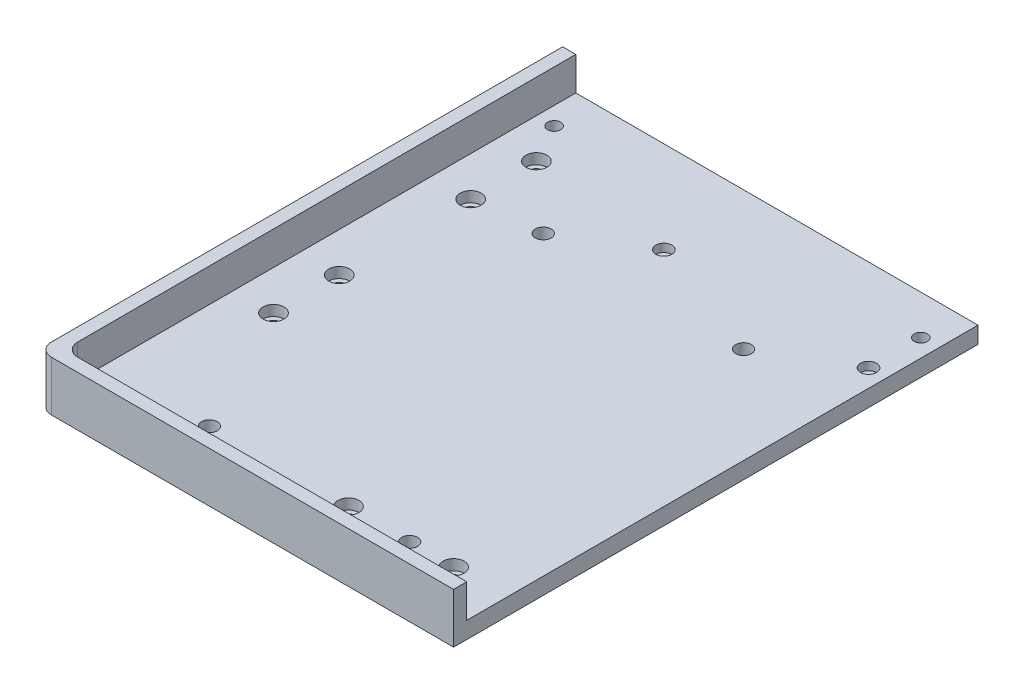
ISO-10303-21;
HEADER;
FILE_DESCRIPTION(('STEP AP214'),'2;1');
FILE_NAME('part.step','',(''),(''),'','','');
FILE_SCHEMA(('AUTOMOTIVE_DESIGN { 1 0 10303 214 1 1 1 1 }'));
ENDSEC;
DATA;
#1=APPLICATION_CONTEXT('core data for automotive mechanical design processes');
#2=APPLICATION_PROTOCOL_DEFINITION('international standard','automotive_design',2000,#1);
#3=PRODUCT_CONTEXT('',#1,'mechanical');
#4=PRODUCT('Part','Part','',(#3));
#5=PRODUCT_RELATED_PRODUCT_CATEGORY('part','',(#4));
#6=PRODUCT_DEFINITION_FORMATION('','',#4);
#7=PRODUCT_DEFINITION_CONTEXT('part definition',#1,'design');
#8=PRODUCT_DEFINITION('design','',#6,#7);
#9=PRODUCT_DEFINITION_SHAPE('','',#8);
#10=(LENGTH_UNIT() NAMED_UNIT(*) SI_UNIT(.MILLI.,.METRE.));
#11=(NAMED_UNIT(*) PLANE_ANGLE_UNIT() SI_UNIT($,.RADIAN.));
#12=(NAMED_UNIT(*) SI_UNIT($,.STERADIAN.) SOLID_ANGLE_UNIT());
#13=UNCERTAINTY_MEASURE_WITH_UNIT(LENGTH_MEASURE(1.E-05),#10,'distance_accuracy_value','');
#14=(GEOMETRIC_REPRESENTATION_CONTEXT(3) GLOBAL_UNCERTAINTY_ASSIGNED_CONTEXT((#13)) GLOBAL_UNIT_ASSIGNED_CONTEXT((#10,
#11,#12)) REPRESENTATION_CONTEXT('',''));
#15=CARTESIAN_POINT('',(0.,0.,0.));
#16=DIRECTION('',(0.,0.,1.));
#17=DIRECTION('',(1.,0.,0.));
#18=AXIS2_PLACEMENT_3D('',#15,#16,#17);
#19=CARTESIAN_POINT('',(0.,6.35,0.));
#20=DIRECTION('',(1.,0.,0.));
#21=DIRECTION('',(0.,0.,-1.));
#22=AXIS2_PLACEMENT_3D('',#19,#20,#21);
#23=PLANE('',#22);
#24=DIRECTION('',(0.,0.,1.));
#25=VECTOR('',#24,1.);
#26=CARTESIAN_POINT('',(0.,0.,0.));
#27=LINE('',#26,#25);
#28=CARTESIAN_POINT('',(0.,0.,0.));
#29=VERTEX_POINT('',#28);
#30=CARTESIAN_POINT('',(0.,0.,194.5));
#31=VERTEX_POINT('',#30);
#32=EDGE_CURVE('E160',#29,#31,#27,.T.);
#33=ORIENTED_EDGE('',*,*,#32,.T.);
#34=DIRECTION('',(0.,-1.,0.));
#35=VECTOR('',#34,1.);
#36=CARTESIAN_POINT('',(0.,6.35,194.5));
#37=LINE('',#36,#35);
#38=CARTESIAN_POINT('',(0.,19.05,194.5));
#39=VERTEX_POINT('',#38);
#40=EDGE_CURVE('E61',#31,#39,#37,.F.);
#41=ORIENTED_EDGE('',*,*,#40,.T.);
#42=DIRECTION('',(0.,0.,1.));
#43=VECTOR('',#42,1.);
#44=CARTESIAN_POINT('',(0.,19.05,0.));
#45=LINE('',#44,#43);
#46=CARTESIAN_POINT('',(0.,19.05,0.));
#47=VERTEX_POINT('',#46);
#48=EDGE_CURVE('E129',#47,#39,#45,.T.);
#49=ORIENTED_EDGE('',*,*,#48,.F.);
#50=DIRECTION('',(0.,-1.,0.));
#51=VECTOR('',#50,1.);
#52=CARTESIAN_POINT('',(0.,6.35,0.));
#53=LINE('',#52,#51);
#54=EDGE_CURVE('E118',#47,#29,#53,.T.);
#55=ORIENTED_EDGE('',*,*,#54,.T.);
#56=EDGE_LOOP('',(#33,#41,#49,#55));
#57=FACE_BOUND('',#56,.T.);
#58=ADVANCED_FACE('F46',(#57),#23,.F.);
#59=CARTESIAN_POINT('',(0.,6.35,199.5));
#60=DIRECTION('',(0.,0.,-1.));
#61=DIRECTION('',(-1.,0.,0.));
#62=AXIS2_PLACEMENT_3D('',#59,#60,#61);
#63=PLANE('',#62);
#64=DIRECTION('',(1.,0.,0.));
#65=VECTOR('',#64,1.);
#66=CARTESIAN_POINT('',(0.,19.05,199.5));
#67=LINE('',#66,#65);
#68=CARTESIAN_POINT('',(5.00000000000005,19.05,199.5));
#69=VERTEX_POINT('',#68);
#70=CARTESIAN_POINT('',(158.,19.05,199.5));
#71=VERTEX_POINT('',#70);
#72=EDGE_CURVE('E132',#69,#71,#67,.T.);
#73=ORIENTED_EDGE('',*,*,#72,.F.);
#74=DIRECTION('',(0.,-1.,0.));
#75=VECTOR('',#74,1.);
#76=CARTESIAN_POINT('',(5.00000000000005,6.35,199.5));
#77=LINE('',#76,#75);
#78=CARTESIAN_POINT('',(5.00000000000005,0.,199.5));
#79=VERTEX_POINT('',#78);
#80=EDGE_CURVE('E182',#69,#79,#77,.T.);
#81=ORIENTED_EDGE('',*,*,#80,.T.);
#82=DIRECTION('',(1.,0.,0.));
#83=VECTOR('',#82,1.);
#84=CARTESIAN_POINT('',(0.,0.,199.5));
#85=LINE('',#84,#83);
#86=CARTESIAN_POINT('',(158.,0.,199.5));
#87=VERTEX_POINT('',#86);
#88=EDGE_CURVE('E166',#79,#87,#85,.T.);
#89=ORIENTED_EDGE('',*,*,#88,.T.);
#90=DIRECTION('',(0.,-1.,0.));
#91=VECTOR('',#90,1.);
#92=CARTESIAN_POINT('',(158.,6.35,199.5));
#93=LINE('',#92,#91);
#94=EDGE_CURVE('E172',#71,#87,#93,.T.);
#95=ORIENTED_EDGE('',*,*,#94,.F.);
#96=EDGE_LOOP('',(#73,#81,#89,#95));
#97=FACE_BOUND('',#96,.T.);
#98=ADVANCED_FACE('F191',(#97),#63,.F.);
#99=CARTESIAN_POINT('',(158.,6.35,0.));
#100=DIRECTION('',(-1.,0.,0.));
#101=DIRECTION('',(0.,0.,1.));
#102=AXIS2_PLACEMENT_3D('',#99,#100,#101);
#103=PLANE('',#102);
#104=DIRECTION('',(0.,0.,-1.));
#105=VECTOR('',#104,1.);
#106=CARTESIAN_POINT('',(158.,0.,0.));
#107=LINE('',#106,#105);
#108=CARTESIAN_POINT('',(158.,0.,0.));
#109=VERTEX_POINT('',#108);
#110=EDGE_CURVE('E168',#87,#109,#107,.T.);
#111=ORIENTED_EDGE('',*,*,#110,.T.);
#112=DIRECTION('',(0.,-1.,0.));
#113=VECTOR('',#112,1.);
#114=CARTESIAN_POINT('',(158.,6.35,0.));
#115=LINE('',#114,#113);
#116=CARTESIAN_POINT('',(158.,6.35,0.));
#117=VERTEX_POINT('',#116);
#118=EDGE_CURVE('E126',#117,#109,#115,.T.);
#119=ORIENTED_EDGE('',*,*,#118,.F.);
#120=DIRECTION('',(0.,0.,-1.));
#121=VECTOR('',#120,1.);
#122=CARTESIAN_POINT('',(158.,6.35,0.));
#123=LINE('',#122,#121);
#124=CARTESIAN_POINT('',(158.,6.35,194.5));
#125=VERTEX_POINT('',#124);
#126=EDGE_CURVE('E161',#125,#117,#123,.T.);
#127=ORIENTED_EDGE('',*,*,#126,.F.);
#128=DIRECTION('',(0.,-1.,0.));
#129=VECTOR('',#128,1.);
#130=CARTESIAN_POINT('',(158.,19.05,194.5));
#131=LINE('',#130,#129);
#132=CARTESIAN_POINT('',(158.,19.05,194.5));
#133=VERTEX_POINT('',#132);
#134=EDGE_CURVE('E157',#133,#125,#131,.T.);
#135=ORIENTED_EDGE('',*,*,#134,.F.);
#136=DIRECTION('',(0.,0.,-1.));
#137=VECTOR('',#136,1.);
#138=CARTESIAN_POINT('',(158.,19.05,199.5));
#139=LINE('',#138,#137);
#140=EDGE_CURVE('E147',#71,#133,#139,.T.);
#141=ORIENTED_EDGE('',*,*,#140,.F.);
#142=ORIENTED_EDGE('',*,*,#94,.T.);
#143=EDGE_LOOP('',(#111,#119,#127,#135,#141,#142));
#144=FACE_BOUND('',#143,.T.);
#145=ADVANCED_FACE('F211',(#144),#103,.F.);
#146=CARTESIAN_POINT('',(0.,6.35,0.));
#147=DIRECTION('',(0.,0.,1.));
#148=DIRECTION('',(1.,0.,0.));
#149=AXIS2_PLACEMENT_3D('',#146,#147,#148);
#150=PLANE('',#149);
#151=DIRECTION('',(-1.,0.,0.));
#152=VECTOR('',#151,1.);
#153=CARTESIAN_POINT('',(0.,0.,0.));
#154=LINE('',#153,#152);
#155=EDGE_CURVE('E125',#109,#29,#154,.T.);
#156=ORIENTED_EDGE('',*,*,#155,.T.);
#157=ORIENTED_EDGE('',*,*,#54,.F.);
#158=DIRECTION('',(-1.,0.,0.));
#159=VECTOR('',#158,1.);
#160=CARTESIAN_POINT('',(0.,19.05,0.));
#161=LINE('',#160,#159);
#162=CARTESIAN_POINT('',(5.,19.05,0.));
#163=VERTEX_POINT('',#162);
#164=EDGE_CURVE('E122',#163,#47,#161,.T.);
#165=ORIENTED_EDGE('',*,*,#164,.F.);
#166=DIRECTION('',(0.,-1.,0.));
#167=VECTOR('',#166,1.);
#168=CARTESIAN_POINT('',(5.,19.05,0.));
#169=LINE('',#168,#167);
#170=CARTESIAN_POINT('',(5.,6.35,0.));
#171=VERTEX_POINT('',#170);
#172=EDGE_CURVE('E153',#163,#171,#169,.T.);
#173=ORIENTED_EDGE('',*,*,#172,.T.);
#174=DIRECTION('',(-1.,0.,0.));
#175=VECTOR('',#174,1.);
#176=CARTESIAN_POINT('',(0.,6.35,0.));
#177=LINE('',#176,#175);
#178=EDGE_CURVE('E127',#117,#171,#177,.T.);
#179=ORIENTED_EDGE('',*,*,#178,.F.);
#180=ORIENTED_EDGE('',*,*,#118,.T.);
#181=EDGE_LOOP('',(#156,#157,#165,#173,#179,#180));
#182=FACE_BOUND('',#181,.T.);
#183=ADVANCED_FACE('F119',(#182),#150,.F.);
#184=CARTESIAN_POINT('',(0.,6.35,0.));
#185=DIRECTION('',(0.,1.,0.));
#186=DIRECTION('',(0.,0.,1.));
#187=AXIS2_PLACEMENT_3D('',#184,#185,#186);
#188=PLANE('',#187);
#189=CARTESIAN_POINT('',(151.25,6.35,34.9));
#190=DIRECTION('',(0.,1.,0.));
#191=DIRECTION('',(0.,0.,1.));
#192=AXIS2_PLACEMENT_3D('',#189,#190,#191);
#193=CIRCLE('',#192,3.04999999999999);
#194=CARTESIAN_POINT('',(151.25,6.35,37.95));
#195=VERTEX_POINT('',#194);
#196=EDGE_CURVE('E347',#195,#195,#193,.T.);
#197=ORIENTED_EDGE('',*,*,#196,.F.);
#198=EDGE_LOOP('',(#197));
#199=FACE_BOUND('',#198,.T.);
#200=CARTESIAN_POINT('',(73.375,6.35,34.9));
#201=DIRECTION('',(0.,1.,0.));
#202=DIRECTION('',(0.,0.,1.));
#203=AXIS2_PLACEMENT_3D('',#200,#201,#202);
#204=CIRCLE('',#203,3.04999999999999);
#205=CARTESIAN_POINT('',(73.375,6.35,37.95));
#206=VERTEX_POINT('',#205);
#207=EDGE_CURVE('E353',#206,#206,#204,.T.);
#208=ORIENTED_EDGE('',*,*,#207,.F.);
#209=EDGE_LOOP('',(#208));
#210=FACE_BOUND('',#209,.T.);
#211=CARTESIAN_POINT('',(11.75,6.35,15.));
#212=DIRECTION('',(0.,1.,0.));
#213=DIRECTION('',(0.,0.,1.));
#214=AXIS2_PLACEMENT_3D('',#211,#212,#213);
#215=CIRCLE('',#214,2.5);
#216=CARTESIAN_POINT('',(11.75,6.35,17.5));
#217=VERTEX_POINT('',#216);
#218=EDGE_CURVE('E365',#217,#217,#215,.T.);
#219=ORIENTED_EDGE('',*,*,#218,.F.);
#220=EDGE_LOOP('',(#219));
#221=FACE_BOUND('',#220,.T.);
#222=CARTESIAN_POINT('',(151.25,6.35,15.));
#223=DIRECTION('',(0.,1.,0.));
#224=DIRECTION('',(0.,0.,1.));
#225=AXIS2_PLACEMENT_3D('',#222,#223,#224);
#226=CIRCLE('',#225,2.5);
#227=CARTESIAN_POINT('',(151.25,6.35,17.5));
#228=VERTEX_POINT('',#227);
#229=EDGE_CURVE('E350',#228,#228,#226,.T.);
#230=ORIENTED_EDGE('',*,*,#229,.F.);
#231=EDGE_LOOP('',(#230));
#232=FACE_BOUND('',#231,.T.);
#233=CARTESIAN_POINT('',(45.1,6.35,179.5));
#234=DIRECTION('',(0.,1.,0.));
#235=DIRECTION('',(0.,0.,1.));
#236=AXIS2_PLACEMENT_3D('',#233,#234,#235);
#237=CIRCLE('',#236,3.00000000000001);
#238=CARTESIAN_POINT('',(45.1,6.35,182.5));
#239=VERTEX_POINT('',#238);
#240=EDGE_CURVE('E383',#239,#239,#237,.T.);
#241=ORIENTED_EDGE('',*,*,#240,.F.);
#242=EDGE_LOOP('',(#241));
#243=FACE_BOUND('',#242,.T.);
#244=CARTESIAN_POINT('',(121.3,6.35,179.5));
#245=DIRECTION('',(0.,1.,0.));
#246=DIRECTION('',(0.,0.,1.));
#247=AXIS2_PLACEMENT_3D('',#244,#245,#246);
#248=CIRCLE('',#247,2.99999999999991);
#249=CARTESIAN_POINT('',(121.3,6.35,182.5));
#250=VERTEX_POINT('',#249);
#251=EDGE_CURVE('E377',#250,#250,#248,.T.);
#252=ORIENTED_EDGE('',*,*,#251,.F.);
#253=EDGE_LOOP('',(#252));
#254=FACE_BOUND('',#253,.T.);
#255=CARTESIAN_POINT('',(121.3,6.35,52.5));
#256=DIRECTION('',(0.,1.,0.));
#257=DIRECTION('',(0.,0.,1.));
#258=AXIS2_PLACEMENT_3D('',#255,#256,#257);
#259=CIRCLE('',#258,2.99999999999991);
#260=CARTESIAN_POINT('',(121.3,6.35,55.4999999999999));
#261=VERTEX_POINT('',#260);
#262=EDGE_CURVE('E370',#261,#261,#259,.T.);
#263=ORIENTED_EDGE('',*,*,#262,.F.);
#264=EDGE_LOOP('',(#263));
#265=FACE_BOUND('',#264,.T.);
#266=CARTESIAN_POINT('',(45.1,6.35,52.5));
#267=DIRECTION('',(0.,1.,0.));
#268=DIRECTION('',(0.,0.,1.));
#269=AXIS2_PLACEMENT_3D('',#266,#267,#268);
#270=CIRCLE('',#269,3.00000000000001);
#271=CARTESIAN_POINT('',(45.1,6.35,55.5));
#272=VERTEX_POINT('',#271);
#273=EDGE_CURVE('E373',#272,#272,#270,.T.);
#274=ORIENTED_EDGE('',*,*,#273,.F.);
#275=EDGE_LOOP('',(#274));
#276=FACE_BOUND('',#275,.T.);
#277=CARTESIAN_POINT('',(98.,6.35,179.5));
#278=DIRECTION('',(0.,1.,0.));
#279=DIRECTION('',(0.,0.,1.));
#280=AXIS2_PLACEMENT_3D('',#277,#278,#279);
#281=CIRCLE('',#280,4.);
#282=CARTESIAN_POINT('',(98.,6.35,183.5));
#283=VERTEX_POINT('',#282);
#284=EDGE_CURVE('E391',#283,#283,#281,.T.);
#285=ORIENTED_EDGE('',*,*,#284,.F.);
#286=EDGE_LOOP('',(#285));
#287=FACE_BOUND('',#286,.T.);
#288=CARTESIAN_POINT('',(138.,6.35,179.5));
#289=DIRECTION('',(0.,1.,0.));
#290=DIRECTION('',(0.,0.,1.));
#291=AXIS2_PLACEMENT_3D('',#288,#289,#290);
#292=CIRCLE('',#291,4.);
#293=CARTESIAN_POINT('',(138.,6.35,183.5));
#294=VERTEX_POINT('',#293);
#295=EDGE_CURVE('E405',#294,#294,#292,.T.);
#296=ORIENTED_EDGE('',*,*,#295,.F.);
#297=EDGE_LOOP('',(#296));
#298=FACE_BOUND('',#297,.T.);
#299=CARTESIAN_POINT('',(20.,6.35,130.));
#300=DIRECTION('',(0.,1.,0.));
#301=DIRECTION('',(0.,0.,1.));
#302=AXIS2_PLACEMENT_3D('',#299,#300,#301);
#303=CIRCLE('',#302,4.);
#304=CARTESIAN_POINT('',(20.,6.35,134.));
#305=VERTEX_POINT('',#304);
#306=EDGE_CURVE('E417',#305,#305,#303,.T.);
#307=ORIENTED_EDGE('',*,*,#306,.F.);
#308=EDGE_LOOP('',(#307));
#309=FACE_BOUND('',#308,.T.);
#310=CARTESIAN_POINT('',(20.,6.35,105.));
#311=DIRECTION('',(0.,1.,0.));
#312=DIRECTION('',(0.,0.,1.));
#313=AXIS2_PLACEMENT_3D('',#310,#311,#312);
#314=CIRCLE('',#313,4.);
#315=CARTESIAN_POINT('',(20.,6.35,109.));
#316=VERTEX_POINT('',#315);
#317=EDGE_CURVE('E429',#316,#316,#314,.T.);
#318=ORIENTED_EDGE('',*,*,#317,.F.);
#319=EDGE_LOOP('',(#318));
#320=FACE_BOUND('',#319,.T.);
#321=CARTESIAN_POINT('',(20.,6.35,30.));
#322=DIRECTION('',(0.,1.,0.));
#323=DIRECTION('',(0.,0.,1.));
#324=AXIS2_PLACEMENT_3D('',#321,#322,#323);
#325=CIRCLE('',#324,4.);
#326=CARTESIAN_POINT('',(20.,6.35,34.));
#327=VERTEX_POINT('',#326);
#328=EDGE_CURVE('E441',#327,#327,#325,.T.);
#329=ORIENTED_EDGE('',*,*,#328,.F.);
#330=EDGE_LOOP('',(#329));
#331=FACE_BOUND('',#330,.T.);
#332=CARTESIAN_POINT('',(20.,6.35,55.));
#333=DIRECTION('',(0.,1.,0.));
#334=DIRECTION('',(0.,0.,1.));
#335=AXIS2_PLACEMENT_3D('',#332,#333,#334);
#336=CIRCLE('',#335,4.);
#337=CARTESIAN_POINT('',(20.,6.35,59.));
#338=VERTEX_POINT('',#337);
#339=EDGE_CURVE('E453',#338,#338,#336,.T.);
#340=ORIENTED_EDGE('',*,*,#339,.F.);
#341=EDGE_LOOP('',(#340));
#342=FACE_BOUND('',#341,.T.);
#343=DIRECTION('',(0.,0.,-1.));
#344=VECTOR('',#343,1.);
#345=CARTESIAN_POINT('',(5.,6.35,0.));
#346=LINE('',#345,#344);
#347=CARTESIAN_POINT('',(5.,6.35,189.5));
#348=VERTEX_POINT('',#347);
#349=EDGE_CURVE('E138',#348,#171,#346,.T.);
#350=ORIENTED_EDGE('',*,*,#349,.F.);
#351=CARTESIAN_POINT('',(10.,6.35,189.5));
#352=DIRECTION('',(0.,1.,0.));
#353=DIRECTION('',(0.,0.,1.));
#354=AXIS2_PLACEMENT_3D('',#351,#352,#353);
#355=CIRCLE('',#354,5.);
#356=CARTESIAN_POINT('',(10.,6.35,194.5));
#357=VERTEX_POINT('',#356);
#358=EDGE_CURVE('E178',#348,#357,#355,.T.);
#359=ORIENTED_EDGE('',*,*,#358,.T.);
#360=DIRECTION('',(-1.,0.,0.));
#361=VECTOR('',#360,1.);
#362=CARTESIAN_POINT('',(5.,6.35,194.5));
#363=LINE('',#362,#361);
#364=EDGE_CURVE('E140',#125,#357,#363,.T.);
#365=ORIENTED_EDGE('',*,*,#364,.F.);
#366=ORIENTED_EDGE('',*,*,#126,.T.);
#367=ORIENTED_EDGE('',*,*,#178,.T.);
#368=EDGE_LOOP('',(#350,#359,#365,#366,#367));
#369=FACE_BOUND('',#368,.T.);
#370=ADVANCED_FACE('F219',(#199,#210,#221,#232,#243,#254,#265,#276,#287,#298,#309,#320,#331,
#342,#369),#188,.T.);
#371=CARTESIAN_POINT('',(0.,0.,0.));
#372=DIRECTION('',(0.,1.,0.));
#373=DIRECTION('',(0.,0.,1.));
#374=AXIS2_PLACEMENT_3D('',#371,#372,#373);
#375=PLANE('',#374);
#376=CARTESIAN_POINT('',(11.75,0.,15.));
#377=DIRECTION('',(0.,1.,0.));
#378=DIRECTION('',(0.,0.,1.));
#379=AXIS2_PLACEMENT_3D('',#376,#377,#378);
#380=CIRCLE('',#379,2.5);
#381=CARTESIAN_POINT('',(11.75,0.,17.5));
#382=VERTEX_POINT('',#381);
#383=EDGE_CURVE('E361',#382,#382,#380,.T.);
#384=ORIENTED_EDGE('',*,*,#383,.T.);
#385=EDGE_LOOP('',(#384));
#386=FACE_BOUND('',#385,.T.);
#387=CARTESIAN_POINT('',(151.25,0.,15.));
#388=DIRECTION('',(0.,1.,0.));
#389=DIRECTION('',(0.,0.,1.));
#390=AXIS2_PLACEMENT_3D('',#387,#388,#389);
#391=CIRCLE('',#390,2.5);
#392=CARTESIAN_POINT('',(151.25,0.,17.5));
#393=VERTEX_POINT('',#392);
#394=EDGE_CURVE('E346',#393,#393,#391,.T.);
#395=ORIENTED_EDGE('',*,*,#394,.T.);
#396=EDGE_LOOP('',(#395));
#397=FACE_BOUND('',#396,.T.);
#398=CARTESIAN_POINT('',(45.1,0.,179.5));
#399=DIRECTION('',(0.,1.,0.));
#400=DIRECTION('',(0.,0.,1.));
#401=AXIS2_PLACEMENT_3D('',#398,#399,#400);
#402=CIRCLE('',#401,3.00000000000001);
#403=CARTESIAN_POINT('',(45.1,0.,182.5));
#404=VERTEX_POINT('',#403);
#405=EDGE_CURVE('E364',#404,#404,#402,.T.);
#406=ORIENTED_EDGE('',*,*,#405,.T.);
#407=EDGE_LOOP('',(#406));
#408=FACE_BOUND('',#407,.T.);
#409=CARTESIAN_POINT('',(121.3,0.,179.5));
#410=DIRECTION('',(0.,1.,0.));
#411=DIRECTION('',(0.,0.,1.));
#412=AXIS2_PLACEMENT_3D('',#409,#410,#411);
#413=CIRCLE('',#412,2.99999999999991);
#414=CARTESIAN_POINT('',(121.3,0.,182.5));
#415=VERTEX_POINT('',#414);
#416=EDGE_CURVE('E380',#415,#415,#413,.T.);
#417=ORIENTED_EDGE('',*,*,#416,.T.);
#418=EDGE_LOOP('',(#417));
#419=FACE_BOUND('',#418,.T.);
#420=CARTESIAN_POINT('',(121.3,0.,52.5));
#421=DIRECTION('',(0.,1.,0.));
#422=DIRECTION('',(0.,0.,1.));
#423=AXIS2_PLACEMENT_3D('',#420,#421,#422);
#424=CIRCLE('',#423,2.99999999999991);
#425=CARTESIAN_POINT('',(121.3,0.,55.4999999999999));
#426=VERTEX_POINT('',#425);
#427=EDGE_CURVE('E374',#426,#426,#424,.T.);
#428=ORIENTED_EDGE('',*,*,#427,.T.);
#429=EDGE_LOOP('',(#428));
#430=FACE_BOUND('',#429,.T.);
#431=CARTESIAN_POINT('',(45.1,0.,52.5));
#432=DIRECTION('',(0.,1.,0.));
#433=DIRECTION('',(0.,0.,1.));
#434=AXIS2_PLACEMENT_3D('',#431,#432,#433);
#435=CIRCLE('',#434,3.00000000000001);
#436=CARTESIAN_POINT('',(45.1,0.,55.5));
#437=VERTEX_POINT('',#436);
#438=EDGE_CURVE('E388',#437,#437,#435,.T.);
#439=ORIENTED_EDGE('',*,*,#438,.T.);
#440=EDGE_LOOP('',(#439));
#441=FACE_BOUND('',#440,.T.);
#442=CARTESIAN_POINT('',(98.,0.,179.5));
#443=DIRECTION('',(0.,1.,0.));
#444=DIRECTION('',(0.,0.,1.));
#445=AXIS2_PLACEMENT_3D('',#442,#443,#444);
#446=CIRCLE('',#445,2.25);
#447=CARTESIAN_POINT('',(98.,0.,181.75));
#448=VERTEX_POINT('',#447);
#449=EDGE_CURVE('E402',#448,#448,#446,.T.);
#450=ORIENTED_EDGE('',*,*,#449,.T.);
#451=EDGE_LOOP('',(#450));
#452=FACE_BOUND('',#451,.T.);
#453=CARTESIAN_POINT('',(138.,0.,179.5));
#454=DIRECTION('',(0.,1.,0.));
#455=DIRECTION('',(0.,0.,1.));
#456=AXIS2_PLACEMENT_3D('',#453,#454,#455);
#457=CIRCLE('',#456,2.25);
#458=CARTESIAN_POINT('',(138.,0.,181.75));
#459=VERTEX_POINT('',#458);
#460=EDGE_CURVE('E414',#459,#459,#457,.T.);
#461=ORIENTED_EDGE('',*,*,#460,.T.);
#462=EDGE_LOOP('',(#461));
#463=FACE_BOUND('',#462,.T.);
#464=CARTESIAN_POINT('',(20.,0.,130.));
#465=DIRECTION('',(0.,1.,0.));
#466=DIRECTION('',(0.,0.,1.));
#467=AXIS2_PLACEMENT_3D('',#464,#465,#466);
#468=CIRCLE('',#467,2.25);
#469=CARTESIAN_POINT('',(20.,0.,132.25));
#470=VERTEX_POINT('',#469);
#471=EDGE_CURVE('E426',#470,#470,#468,.T.);
#472=ORIENTED_EDGE('',*,*,#471,.T.);
#473=EDGE_LOOP('',(#472));
#474=FACE_BOUND('',#473,.T.);
#475=CARTESIAN_POINT('',(20.,0.,105.));
#476=DIRECTION('',(0.,1.,0.));
#477=DIRECTION('',(0.,0.,1.));
#478=AXIS2_PLACEMENT_3D('',#475,#476,#477);
#479=CIRCLE('',#478,2.25);
#480=CARTESIAN_POINT('',(20.,0.,107.25));
#481=VERTEX_POINT('',#480);
#482=EDGE_CURVE('E438',#481,#481,#479,.T.);
#483=ORIENTED_EDGE('',*,*,#482,.T.);
#484=EDGE_LOOP('',(#483));
#485=FACE_BOUND('',#484,.T.);
#486=CARTESIAN_POINT('',(20.,0.,30.));
#487=DIRECTION('',(0.,1.,0.));
#488=DIRECTION('',(0.,0.,1.));
#489=AXIS2_PLACEMENT_3D('',#486,#487,#488);
#490=CIRCLE('',#489,2.25);
#491=CARTESIAN_POINT('',(20.,0.,32.25));
#492=VERTEX_POINT('',#491);
#493=EDGE_CURVE('E450',#492,#492,#490,.T.);
#494=ORIENTED_EDGE('',*,*,#493,.T.);
#495=EDGE_LOOP('',(#494));
#496=FACE_BOUND('',#495,.T.);
#497=CARTESIAN_POINT('',(20.,0.,55.));
#498=DIRECTION('',(0.,1.,0.));
#499=DIRECTION('',(0.,0.,1.));
#500=AXIS2_PLACEMENT_3D('',#497,#498,#499);
#501=CIRCLE('',#500,2.25);
#502=CARTESIAN_POINT('',(20.,0.,57.25));
#503=VERTEX_POINT('',#502);
#504=EDGE_CURVE('E143',#503,#503,#501,.T.);
#505=ORIENTED_EDGE('',*,*,#504,.T.);
#506=EDGE_LOOP('',(#505));
#507=FACE_BOUND('',#506,.T.);
#508=ORIENTED_EDGE('',*,*,#88,.F.);
#509=CARTESIAN_POINT('',(5.00000000000005,0.,194.5));
#510=DIRECTION('',(0.,1.,0.));
#511=DIRECTION('',(0.,0.,1.));
#512=AXIS2_PLACEMENT_3D('',#509,#510,#511);
#513=CIRCLE('',#512,5.);
#514=EDGE_CURVE('E69',#79,#31,#513,.F.);
#515=ORIENTED_EDGE('',*,*,#514,.T.);
#516=ORIENTED_EDGE('',*,*,#32,.F.);
#517=ORIENTED_EDGE('',*,*,#155,.F.);
#518=ORIENTED_EDGE('',*,*,#110,.F.);
#519=EDGE_LOOP('',(#508,#515,#516,#517,#518));
#520=FACE_BOUND('',#519,.T.);
#521=ADVANCED_FACE('F220',(#386,#397,#408,#419,#430,#441,#452,#463,#474,#485,#496,#507,#520),
#375,.F.);
#522=CARTESIAN_POINT('',(5.,19.05,194.5));
#523=DIRECTION('',(0.,0.,1.));
#524=DIRECTION('',(1.,0.,0.));
#525=AXIS2_PLACEMENT_3D('',#522,#523,#524);
#526=PLANE('',#525);
#527=ORIENTED_EDGE('',*,*,#364,.T.);
#528=DIRECTION('',(0.,-1.,0.));
#529=VECTOR('',#528,1.);
#530=CARTESIAN_POINT('',(10.,19.05,194.5));
#531=LINE('',#530,#529);
#532=CARTESIAN_POINT('',(10.,19.05,194.5));
#533=VERTEX_POINT('',#532);
#534=EDGE_CURVE('E180',#357,#533,#531,.F.);
#535=ORIENTED_EDGE('',*,*,#534,.T.);
#536=DIRECTION('',(-1.,0.,0.));
#537=VECTOR('',#536,1.);
#538=CARTESIAN_POINT('',(5.,19.05,194.5));
#539=LINE('',#538,#537);
#540=EDGE_CURVE('E149',#133,#533,#539,.T.);
#541=ORIENTED_EDGE('',*,*,#540,.F.);
#542=ORIENTED_EDGE('',*,*,#134,.T.);
#543=EDGE_LOOP('',(#527,#535,#541,#542));
#544=FACE_BOUND('',#543,.T.);
#545=ADVANCED_FACE('F223',(#544),#526,.F.);
#546=CARTESIAN_POINT('',(5.,19.05,0.));
#547=DIRECTION('',(-1.,0.,0.));
#548=DIRECTION('',(0.,0.,1.));
#549=AXIS2_PLACEMENT_3D('',#546,#547,#548);
#550=PLANE('',#549);
#551=DIRECTION('',(0.,0.,-1.));
#552=VECTOR('',#551,1.);
#553=CARTESIAN_POINT('',(5.,19.05,0.));
#554=LINE('',#553,#552);
#555=CARTESIAN_POINT('',(5.,19.05,189.5));
#556=VERTEX_POINT('',#555);
#557=EDGE_CURVE('E136',#556,#163,#554,.T.);
#558=ORIENTED_EDGE('',*,*,#557,.F.);
#559=DIRECTION('',(0.,-1.,0.));
#560=VECTOR('',#559,1.);
#561=CARTESIAN_POINT('',(5.,6.35,189.5));
#562=LINE('',#561,#560);
#563=EDGE_CURVE('E175',#556,#348,#562,.T.);
#564=ORIENTED_EDGE('',*,*,#563,.T.);
#565=ORIENTED_EDGE('',*,*,#349,.T.);
#566=ORIENTED_EDGE('',*,*,#172,.F.);
#567=EDGE_LOOP('',(#558,#564,#565,#566));
#568=FACE_BOUND('',#567,.T.);
#569=ADVANCED_FACE('F230',(#568),#550,.F.);
#570=CARTESIAN_POINT('',(0.,19.05,0.));
#571=DIRECTION('',(0.,-1.,0.));
#572=DIRECTION('',(0.,0.,-1.));
#573=AXIS2_PLACEMENT_3D('',#570,#571,#572);
#574=PLANE('',#573);
#575=ORIENTED_EDGE('',*,*,#48,.T.);
#576=CARTESIAN_POINT('',(5.00000000000005,19.05,194.5));
#577=DIRECTION('',(0.,-1.,0.));
#578=DIRECTION('',(0.,0.,-1.));
#579=AXIS2_PLACEMENT_3D('',#576,#577,#578);
#580=CIRCLE('',#579,5.);
#581=EDGE_CURVE('E54',#39,#69,#580,.F.);
#582=ORIENTED_EDGE('',*,*,#581,.T.);
#583=ORIENTED_EDGE('',*,*,#72,.T.);
#584=ORIENTED_EDGE('',*,*,#140,.T.);
#585=ORIENTED_EDGE('',*,*,#540,.T.);
#586=CARTESIAN_POINT('',(10.,19.05,189.5));
#587=DIRECTION('',(0.,-1.,0.));
#588=DIRECTION('',(0.,0.,-1.));
#589=AXIS2_PLACEMENT_3D('',#586,#587,#588);
#590=CIRCLE('',#589,5.);
#591=EDGE_CURVE('E11',#533,#556,#590,.T.);
#592=ORIENTED_EDGE('',*,*,#591,.T.);
#593=ORIENTED_EDGE('',*,*,#557,.T.);
#594=ORIENTED_EDGE('',*,*,#164,.T.);
#595=EDGE_LOOP('',(#575,#582,#583,#584,#585,#592,#593,#594));
#596=FACE_BOUND('',#595,.T.);
#597=ADVANCED_FACE('F134',(#596),#574,.F.);
#598=CARTESIAN_POINT('',(20.,6.35,55.));
#599=DIRECTION('',(0.,1.,0.));
#600=DIRECTION('',(0.,0.,1.));
#601=AXIS2_PLACEMENT_3D('',#598,#599,#600);
#602=CYLINDRICAL_SURFACE('',#601,2.25);
#603=ORIENTED_EDGE('',*,*,#504,.F.);
#604=EDGE_LOOP('',(#603));
#605=FACE_BOUND('',#604,.T.);
#606=CARTESIAN_POINT('',(20.,2.35,55.));
#607=DIRECTION('',(0.,1.,0.));
#608=DIRECTION('',(0.,0.,1.));
#609=AXIS2_PLACEMENT_3D('',#606,#607,#608);
#610=CIRCLE('',#609,2.25);
#611=CARTESIAN_POINT('',(20.,2.35,57.25));
#612=VERTEX_POINT('',#611);
#613=EDGE_CURVE('E458',#612,#612,#610,.T.);
#614=ORIENTED_EDGE('',*,*,#613,.T.);
#615=EDGE_LOOP('',(#614));
#616=FACE_BOUND('',#615,.T.);
#617=ADVANCED_FACE('F237',(#605,#616),#602,.F.);
#618=CARTESIAN_POINT('',(22.25,2.35,55.));
#619=DIRECTION('',(0.,-1.,0.));
#620=DIRECTION('',(0.,0.,-1.));
#621=AXIS2_PLACEMENT_3D('',#618,#619,#620);
#622=PLANE('',#621);
#623=ORIENTED_EDGE('',*,*,#613,.F.);
#624=EDGE_LOOP('',(#623));
#625=FACE_BOUND('',#624,.T.);
#626=CARTESIAN_POINT('',(20.,2.35,55.));
#627=DIRECTION('',(0.,1.,0.));
#628=DIRECTION('',(0.,0.,1.));
#629=AXIS2_PLACEMENT_3D('',#626,#627,#628);
#630=CIRCLE('',#629,4.);
#631=CARTESIAN_POINT('',(20.,2.35,59.));
#632=VERTEX_POINT('',#631);
#633=EDGE_CURVE('E456',#632,#632,#630,.T.);
#634=ORIENTED_EDGE('',*,*,#633,.T.);
#635=EDGE_LOOP('',(#634));
#636=FACE_BOUND('',#635,.T.);
#637=ADVANCED_FACE('F240',(#625,#636),#622,.F.);
#638=CARTESIAN_POINT('',(20.,6.35,55.));
#639=DIRECTION('',(0.,1.,0.));
#640=DIRECTION('',(0.,0.,1.));
#641=AXIS2_PLACEMENT_3D('',#638,#639,#640);
#642=CYLINDRICAL_SURFACE('',#641,4.);
#643=ORIENTED_EDGE('',*,*,#633,.F.);
#644=EDGE_LOOP('',(#643));
#645=FACE_BOUND('',#644,.T.);
#646=ORIENTED_EDGE('',*,*,#339,.T.);
#647=EDGE_LOOP('',(#646));
#648=FACE_BOUND('',#647,.T.);
#649=ADVANCED_FACE('F244',(#645,#648),#642,.F.);
#650=CARTESIAN_POINT('',(20.,6.35,30.));
#651=DIRECTION('',(0.,1.,0.));
#652=DIRECTION('',(0.,0.,1.));
#653=AXIS2_PLACEMENT_3D('',#650,#651,#652);
#654=CYLINDRICAL_SURFACE('',#653,2.25);
#655=ORIENTED_EDGE('',*,*,#493,.F.);
#656=EDGE_LOOP('',(#655));
#657=FACE_BOUND('',#656,.T.);
#658=CARTESIAN_POINT('',(20.,2.35,30.));
#659=DIRECTION('',(0.,1.,0.));
#660=DIRECTION('',(0.,0.,1.));
#661=AXIS2_PLACEMENT_3D('',#658,#659,#660);
#662=CIRCLE('',#661,2.25);
#663=CARTESIAN_POINT('',(20.,2.35,32.25));
#664=VERTEX_POINT('',#663);
#665=EDGE_CURVE('E447',#664,#664,#662,.T.);
#666=ORIENTED_EDGE('',*,*,#665,.T.);
#667=EDGE_LOOP('',(#666));
#668=FACE_BOUND('',#667,.T.);
#669=ADVANCED_FACE('F248',(#657,#668),#654,.F.);
#670=CARTESIAN_POINT('',(22.25,2.35,30.));
#671=DIRECTION('',(0.,-1.,0.));
#672=DIRECTION('',(0.,0.,-1.));
#673=AXIS2_PLACEMENT_3D('',#670,#671,#672);
#674=PLANE('',#673);
#675=ORIENTED_EDGE('',*,*,#665,.F.);
#676=EDGE_LOOP('',(#675));
#677=FACE_BOUND('',#676,.T.);
#678=CARTESIAN_POINT('',(20.,2.35,30.));
#679=DIRECTION('',(0.,1.,0.));
#680=DIRECTION('',(0.,0.,1.));
#681=AXIS2_PLACEMENT_3D('',#678,#679,#680);
#682=CIRCLE('',#681,4.);
#683=CARTESIAN_POINT('',(20.,2.35,34.));
#684=VERTEX_POINT('',#683);
#685=EDGE_CURVE('E444',#684,#684,#682,.T.);
#686=ORIENTED_EDGE('',*,*,#685,.T.);
#687=EDGE_LOOP('',(#686));
#688=FACE_BOUND('',#687,.T.);
#689=ADVANCED_FACE('F252',(#677,#688),#674,.F.);
#690=CARTESIAN_POINT('',(20.,6.35,30.));
#691=DIRECTION('',(0.,1.,0.));
#692=DIRECTION('',(0.,0.,1.));
#693=AXIS2_PLACEMENT_3D('',#690,#691,#692);
#694=CYLINDRICAL_SURFACE('',#693,4.);
#695=ORIENTED_EDGE('',*,*,#685,.F.);
#696=EDGE_LOOP('',(#695));
#697=FACE_BOUND('',#696,.T.);
#698=ORIENTED_EDGE('',*,*,#328,.T.);
#699=EDGE_LOOP('',(#698));
#700=FACE_BOUND('',#699,.T.);
#701=ADVANCED_FACE('F256',(#697,#700),#694,.F.);
#702=CARTESIAN_POINT('',(20.,6.35,105.));
#703=DIRECTION('',(0.,1.,0.));
#704=DIRECTION('',(0.,0.,1.));
#705=AXIS2_PLACEMENT_3D('',#702,#703,#704);
#706=CYLINDRICAL_SURFACE('',#705,2.25);
#707=ORIENTED_EDGE('',*,*,#482,.F.);
#708=EDGE_LOOP('',(#707));
#709=FACE_BOUND('',#708,.T.);
#710=CARTESIAN_POINT('',(20.,2.35,105.));
#711=DIRECTION('',(0.,1.,0.));
#712=DIRECTION('',(0.,0.,1.));
#713=AXIS2_PLACEMENT_3D('',#710,#711,#712);
#714=CIRCLE('',#713,2.25);
#715=CARTESIAN_POINT('',(20.,2.35,107.25));
#716=VERTEX_POINT('',#715);
#717=EDGE_CURVE('E435',#716,#716,#714,.T.);
#718=ORIENTED_EDGE('',*,*,#717,.T.);
#719=EDGE_LOOP('',(#718));
#720=FACE_BOUND('',#719,.T.);
#721=ADVANCED_FACE('F260',(#709,#720),#706,.F.);
#722=CARTESIAN_POINT('',(22.25,2.35,105.));
#723=DIRECTION('',(0.,-1.,0.));
#724=DIRECTION('',(0.,0.,-1.));
#725=AXIS2_PLACEMENT_3D('',#722,#723,#724);
#726=PLANE('',#725);
#727=ORIENTED_EDGE('',*,*,#717,.F.);
#728=EDGE_LOOP('',(#727));
#729=FACE_BOUND('',#728,.T.);
#730=CARTESIAN_POINT('',(20.,2.35,105.));
#731=DIRECTION('',(0.,1.,0.));
#732=DIRECTION('',(0.,0.,1.));
#733=AXIS2_PLACEMENT_3D('',#730,#731,#732);
#734=CIRCLE('',#733,4.);
#735=CARTESIAN_POINT('',(20.,2.35,109.));
#736=VERTEX_POINT('',#735);
#737=EDGE_CURVE('E432',#736,#736,#734,.T.);
#738=ORIENTED_EDGE('',*,*,#737,.T.);
#739=EDGE_LOOP('',(#738));
#740=FACE_BOUND('',#739,.T.);
#741=ADVANCED_FACE('F264',(#729,#740),#726,.F.);
#742=CARTESIAN_POINT('',(20.,6.35,105.));
#743=DIRECTION('',(0.,1.,0.));
#744=DIRECTION('',(0.,0.,1.));
#745=AXIS2_PLACEMENT_3D('',#742,#743,#744);
#746=CYLINDRICAL_SURFACE('',#745,4.);
#747=ORIENTED_EDGE('',*,*,#737,.F.);
#748=EDGE_LOOP('',(#747));
#749=FACE_BOUND('',#748,.T.);
#750=ORIENTED_EDGE('',*,*,#317,.T.);
#751=EDGE_LOOP('',(#750));
#752=FACE_BOUND('',#751,.T.);
#753=ADVANCED_FACE('F268',(#749,#752),#746,.F.);
#754=CARTESIAN_POINT('',(20.,6.35,130.));
#755=DIRECTION('',(0.,1.,0.));
#756=DIRECTION('',(0.,0.,1.));
#757=AXIS2_PLACEMENT_3D('',#754,#755,#756);
#758=CYLINDRICAL_SURFACE('',#757,2.25);
#759=ORIENTED_EDGE('',*,*,#471,.F.);
#760=EDGE_LOOP('',(#759));
#761=FACE_BOUND('',#760,.T.);
#762=CARTESIAN_POINT('',(20.,2.35,130.));
#763=DIRECTION('',(0.,1.,0.));
#764=DIRECTION('',(0.,0.,1.));
#765=AXIS2_PLACEMENT_3D('',#762,#763,#764);
#766=CIRCLE('',#765,2.25);
#767=CARTESIAN_POINT('',(20.,2.35,132.25));
#768=VERTEX_POINT('',#767);
#769=EDGE_CURVE('E423',#768,#768,#766,.T.);
#770=ORIENTED_EDGE('',*,*,#769,.T.);
#771=EDGE_LOOP('',(#770));
#772=FACE_BOUND('',#771,.T.);
#773=ADVANCED_FACE('F272',(#761,#772),#758,.F.);
#774=CARTESIAN_POINT('',(22.25,2.35,130.));
#775=DIRECTION('',(0.,-1.,0.));
#776=DIRECTION('',(0.,0.,-1.));
#777=AXIS2_PLACEMENT_3D('',#774,#775,#776);
#778=PLANE('',#777);
#779=ORIENTED_EDGE('',*,*,#769,.F.);
#780=EDGE_LOOP('',(#779));
#781=FACE_BOUND('',#780,.T.);
#782=CARTESIAN_POINT('',(20.,2.35,130.));
#783=DIRECTION('',(0.,1.,0.));
#784=DIRECTION('',(0.,0.,1.));
#785=AXIS2_PLACEMENT_3D('',#782,#783,#784);
#786=CIRCLE('',#785,4.);
#787=CARTESIAN_POINT('',(20.,2.35,134.));
#788=VERTEX_POINT('',#787);
#789=EDGE_CURVE('E420',#788,#788,#786,.T.);
#790=ORIENTED_EDGE('',*,*,#789,.T.);
#791=EDGE_LOOP('',(#790));
#792=FACE_BOUND('',#791,.T.);
#793=ADVANCED_FACE('F276',(#781,#792),#778,.F.);
#794=CARTESIAN_POINT('',(20.,6.35,130.));
#795=DIRECTION('',(0.,1.,0.));
#796=DIRECTION('',(0.,0.,1.));
#797=AXIS2_PLACEMENT_3D('',#794,#795,#796);
#798=CYLINDRICAL_SURFACE('',#797,4.);
#799=ORIENTED_EDGE('',*,*,#789,.F.);
#800=EDGE_LOOP('',(#799));
#801=FACE_BOUND('',#800,.T.);
#802=ORIENTED_EDGE('',*,*,#306,.T.);
#803=EDGE_LOOP('',(#802));
#804=FACE_BOUND('',#803,.T.);
#805=ADVANCED_FACE('F280',(#801,#804),#798,.F.);
#806=CARTESIAN_POINT('',(138.,6.35,179.5));
#807=DIRECTION('',(0.,1.,0.));
#808=DIRECTION('',(0.,0.,1.));
#809=AXIS2_PLACEMENT_3D('',#806,#807,#808);
#810=CYLINDRICAL_SURFACE('',#809,2.25);
#811=ORIENTED_EDGE('',*,*,#460,.F.);
#812=EDGE_LOOP('',(#811));
#813=FACE_BOUND('',#812,.T.);
#814=CARTESIAN_POINT('',(138.,2.35,179.5));
#815=DIRECTION('',(0.,1.,0.));
#816=DIRECTION('',(0.,0.,1.));
#817=AXIS2_PLACEMENT_3D('',#814,#815,#816);
#818=CIRCLE('',#817,2.25);
#819=CARTESIAN_POINT('',(138.,2.35,181.75));
#820=VERTEX_POINT('',#819);
#821=EDGE_CURVE('E411',#820,#820,#818,.T.);
#822=ORIENTED_EDGE('',*,*,#821,.T.);
#823=EDGE_LOOP('',(#822));
#824=FACE_BOUND('',#823,.T.);
#825=ADVANCED_FACE('F284',(#813,#824),#810,.F.);
#826=CARTESIAN_POINT('',(140.25,2.35,179.5));
#827=DIRECTION('',(0.,-1.,0.));
#828=DIRECTION('',(0.,0.,-1.));
#829=AXIS2_PLACEMENT_3D('',#826,#827,#828);
#830=PLANE('',#829);
#831=ORIENTED_EDGE('',*,*,#821,.F.);
#832=EDGE_LOOP('',(#831));
#833=FACE_BOUND('',#832,.T.);
#834=CARTESIAN_POINT('',(138.,2.35,179.5));
#835=DIRECTION('',(0.,1.,0.));
#836=DIRECTION('',(0.,0.,1.));
#837=AXIS2_PLACEMENT_3D('',#834,#835,#836);
#838=CIRCLE('',#837,4.);
#839=CARTESIAN_POINT('',(138.,2.35,183.5));
#840=VERTEX_POINT('',#839);
#841=EDGE_CURVE('E408',#840,#840,#838,.T.);
#842=ORIENTED_EDGE('',*,*,#841,.T.);
#843=EDGE_LOOP('',(#842));
#844=FACE_BOUND('',#843,.T.);
#845=ADVANCED_FACE('F288',(#833,#844),#830,.F.);
#846=CARTESIAN_POINT('',(138.,6.35,179.5));
#847=DIRECTION('',(0.,1.,0.));
#848=DIRECTION('',(0.,0.,1.));
#849=AXIS2_PLACEMENT_3D('',#846,#847,#848);
#850=CYLINDRICAL_SURFACE('',#849,4.);
#851=ORIENTED_EDGE('',*,*,#841,.F.);
#852=EDGE_LOOP('',(#851));
#853=FACE_BOUND('',#852,.T.);
#854=ORIENTED_EDGE('',*,*,#295,.T.);
#855=EDGE_LOOP('',(#854));
#856=FACE_BOUND('',#855,.T.);
#857=ADVANCED_FACE('F292',(#853,#856),#850,.F.);
#858=CARTESIAN_POINT('',(98.,6.35,179.5));
#859=DIRECTION('',(0.,1.,0.));
#860=DIRECTION('',(0.,0.,1.));
#861=AXIS2_PLACEMENT_3D('',#858,#859,#860);
#862=CYLINDRICAL_SURFACE('',#861,2.25);
#863=ORIENTED_EDGE('',*,*,#449,.F.);
#864=EDGE_LOOP('',(#863));
#865=FACE_BOUND('',#864,.T.);
#866=CARTESIAN_POINT('',(98.,2.35,179.5));
#867=DIRECTION('',(0.,1.,0.));
#868=DIRECTION('',(0.,0.,1.));
#869=AXIS2_PLACEMENT_3D('',#866,#867,#868);
#870=CIRCLE('',#869,2.25);
#871=CARTESIAN_POINT('',(98.,2.35,181.75));
#872=VERTEX_POINT('',#871);
#873=EDGE_CURVE('E399',#872,#872,#870,.T.);
#874=ORIENTED_EDGE('',*,*,#873,.T.);
#875=EDGE_LOOP('',(#874));
#876=FACE_BOUND('',#875,.T.);
#877=ADVANCED_FACE('F296',(#865,#876),#862,.F.);
#878=CARTESIAN_POINT('',(100.25,2.35,179.5));
#879=DIRECTION('',(0.,-1.,0.));
#880=DIRECTION('',(0.,0.,-1.));
#881=AXIS2_PLACEMENT_3D('',#878,#879,#880);
#882=PLANE('',#881);
#883=ORIENTED_EDGE('',*,*,#873,.F.);
#884=EDGE_LOOP('',(#883));
#885=FACE_BOUND('',#884,.T.);
#886=CARTESIAN_POINT('',(98.,2.35,179.5));
#887=DIRECTION('',(0.,1.,0.));
#888=DIRECTION('',(0.,0.,1.));
#889=AXIS2_PLACEMENT_3D('',#886,#887,#888);
#890=CIRCLE('',#889,4.);
#891=CARTESIAN_POINT('',(98.,2.35,183.5));
#892=VERTEX_POINT('',#891);
#893=EDGE_CURVE('E396',#892,#892,#890,.T.);
#894=ORIENTED_EDGE('',*,*,#893,.T.);
#895=EDGE_LOOP('',(#894));
#896=FACE_BOUND('',#895,.T.);
#897=ADVANCED_FACE('F300',(#885,#896),#882,.F.);
#898=CARTESIAN_POINT('',(98.,6.35,179.5));
#899=DIRECTION('',(0.,1.,0.));
#900=DIRECTION('',(0.,0.,1.));
#901=AXIS2_PLACEMENT_3D('',#898,#899,#900);
#902=CYLINDRICAL_SURFACE('',#901,4.);
#903=ORIENTED_EDGE('',*,*,#893,.F.);
#904=EDGE_LOOP('',(#903));
#905=FACE_BOUND('',#904,.T.);
#906=ORIENTED_EDGE('',*,*,#284,.T.);
#907=EDGE_LOOP('',(#906));
#908=FACE_BOUND('',#907,.T.);
#909=ADVANCED_FACE('F203',(#905,#908),#902,.F.);
#910=CARTESIAN_POINT('',(10.,19.05,189.5));
#911=DIRECTION('',(0.,1.,0.));
#912=DIRECTION('',(0.,0.,1.));
#913=AXIS2_PLACEMENT_3D('',#910,#911,#912);
#914=CYLINDRICAL_SURFACE('',#913,5.);
#915=ORIENTED_EDGE('',*,*,#591,.F.);
#916=ORIENTED_EDGE('',*,*,#534,.F.);
#917=ORIENTED_EDGE('',*,*,#358,.F.);
#918=ORIENTED_EDGE('',*,*,#563,.F.);
#919=EDGE_LOOP('',(#915,#916,#917,#918));
#920=FACE_BOUND('',#919,.T.);
#921=ADVANCED_FACE('F195',(#920),#914,.F.);
#922=CARTESIAN_POINT('',(5.00000000000005,6.35,194.5));
#923=DIRECTION('',(0.,-1.,0.));
#924=DIRECTION('',(0.,0.,-1.));
#925=AXIS2_PLACEMENT_3D('',#922,#923,#924);
#926=CYLINDRICAL_SURFACE('',#925,5.);
#927=ORIENTED_EDGE('',*,*,#581,.F.);
#928=ORIENTED_EDGE('',*,*,#40,.F.);
#929=ORIENTED_EDGE('',*,*,#514,.F.);
#930=ORIENTED_EDGE('',*,*,#80,.F.);
#931=EDGE_LOOP('',(#927,#928,#929,#930));
#932=FACE_BOUND('',#931,.T.);
#933=ADVANCED_FACE('F48',(#932),#926,.T.);
#934=CARTESIAN_POINT('',(45.1,0.,52.5));
#935=DIRECTION('',(0.,1.,0.));
#936=DIRECTION('',(0.,0.,1.));
#937=AXIS2_PLACEMENT_3D('',#934,#935,#936);
#938=CYLINDRICAL_SURFACE('',#937,3.00000000000001);
#939=ORIENTED_EDGE('',*,*,#438,.F.);
#940=EDGE_LOOP('',(#939));
#941=FACE_BOUND('',#940,.T.);
#942=ORIENTED_EDGE('',*,*,#273,.T.);
#943=EDGE_LOOP('',(#942));
#944=FACE_BOUND('',#943,.T.);
#945=ADVANCED_FACE('F194',(#941,#944),#938,.F.);
#946=CARTESIAN_POINT('',(121.3,0.,52.5));
#947=DIRECTION('',(0.,1.,0.));
#948=DIRECTION('',(0.,0.,1.));
#949=AXIS2_PLACEMENT_3D('',#946,#947,#948);
#950=CYLINDRICAL_SURFACE('',#949,2.99999999999991);
#951=ORIENTED_EDGE('',*,*,#427,.F.);
#952=EDGE_LOOP('',(#951));
#953=FACE_BOUND('',#952,.T.);
#954=ORIENTED_EDGE('',*,*,#262,.T.);
#955=EDGE_LOOP('',(#954));
#956=FACE_BOUND('',#955,.T.);
#957=ADVANCED_FACE('F200',(#953,#956),#950,.F.);
#958=CARTESIAN_POINT('',(121.3,0.,179.5));
#959=DIRECTION('',(0.,1.,0.));
#960=DIRECTION('',(0.,0.,1.));
#961=AXIS2_PLACEMENT_3D('',#958,#959,#960);
#962=CYLINDRICAL_SURFACE('',#961,2.99999999999991);
#963=ORIENTED_EDGE('',*,*,#416,.F.);
#964=EDGE_LOOP('',(#963));
#965=FACE_BOUND('',#964,.T.);
#966=ORIENTED_EDGE('',*,*,#251,.T.);
#967=EDGE_LOOP('',(#966));
#968=FACE_BOUND('',#967,.T.);
#969=ADVANCED_FACE('F311',(#965,#968),#962,.F.);
#970=CARTESIAN_POINT('',(45.1,0.,179.5));
#971=DIRECTION('',(0.,1.,0.));
#972=DIRECTION('',(0.,0.,1.));
#973=AXIS2_PLACEMENT_3D('',#970,#971,#972);
#974=CYLINDRICAL_SURFACE('',#973,3.00000000000001);
#975=ORIENTED_EDGE('',*,*,#405,.F.);
#976=EDGE_LOOP('',(#975));
#977=FACE_BOUND('',#976,.T.);
#978=ORIENTED_EDGE('',*,*,#240,.T.);
#979=EDGE_LOOP('',(#978));
#980=FACE_BOUND('',#979,.T.);
#981=ADVANCED_FACE('F307',(#977,#980),#974,.F.);
#982=CARTESIAN_POINT('',(151.25,0.,15.));
#983=DIRECTION('',(0.,1.,0.));
#984=DIRECTION('',(0.,0.,1.));
#985=AXIS2_PLACEMENT_3D('',#982,#983,#984);
#986=CYLINDRICAL_SURFACE('',#985,2.5);
#987=ORIENTED_EDGE('',*,*,#394,.F.);
#988=EDGE_LOOP('',(#987));
#989=FACE_BOUND('',#988,.T.);
#990=ORIENTED_EDGE('',*,*,#229,.T.);
#991=EDGE_LOOP('',(#990));
#992=FACE_BOUND('',#991,.T.);
#993=ADVANCED_FACE('F310',(#989,#992),#986,.F.);
#994=CARTESIAN_POINT('',(11.75,0.,15.));
#995=DIRECTION('',(0.,1.,0.));
#996=DIRECTION('',(0.,0.,1.));
#997=AXIS2_PLACEMENT_3D('',#994,#995,#996);
#998=CYLINDRICAL_SURFACE('',#997,2.5);
#999=ORIENTED_EDGE('',*,*,#383,.F.);
#1000=EDGE_LOOP('',(#999));
#1001=FACE_BOUND('',#1000,.T.);
#1002=ORIENTED_EDGE('',*,*,#218,.T.);
#1003=EDGE_LOOP('',(#1002));
#1004=FACE_BOUND('',#1003,.T.);
#1005=ADVANCED_FACE('F321',(#1001,#1004),#998,.F.);
#1006=CARTESIAN_POINT('',(73.375,3.25,34.9));
#1007=DIRECTION('',(0.,1.,0.));
#1008=DIRECTION('',(0.,0.,1.));
#1009=AXIS2_PLACEMENT_3D('',#1006,#1007,#1008);
#1010=CYLINDRICAL_SURFACE('',#1009,3.04999999999999);
#1011=CARTESIAN_POINT('',(73.375,3.25,34.9));
#1012=DIRECTION('',(0.,1.,0.));
#1013=DIRECTION('',(0.,0.,1.));
#1014=AXIS2_PLACEMENT_3D('',#1011,#1012,#1013);
#1015=CIRCLE('',#1014,3.04999999999999);
#1016=CARTESIAN_POINT('',(73.375,3.25,37.95));
#1017=VERTEX_POINT('',#1016);
#1018=EDGE_CURVE('E358',#1017,#1017,#1015,.T.);
#1019=ORIENTED_EDGE('',*,*,#1018,.F.);
#1020=EDGE_LOOP('',(#1019));
#1021=FACE_BOUND('',#1020,.T.);
#1022=ORIENTED_EDGE('',*,*,#207,.T.);
#1023=EDGE_LOOP('',(#1022));
#1024=FACE_BOUND('',#1023,.T.);
#1025=ADVANCED_FACE('F325',(#1021,#1024),#1010,.F.);
#1026=CARTESIAN_POINT('',(73.375,3.25,34.9));
#1027=DIRECTION('',(0.,1.,0.));
#1028=DIRECTION('',(0.,0.,1.));
#1029=AXIS2_PLACEMENT_3D('',#1026,#1027,#1028);
#1030=PLANE('',#1029);
#1031=ORIENTED_EDGE('',*,*,#1018,.T.);
#1032=EDGE_LOOP('',(#1031));
#1033=FACE_BOUND('',#1032,.T.);
#1034=ADVANCED_FACE('F327',(#1033),#1030,.T.);
#1035=CARTESIAN_POINT('',(151.25,3.25,34.9));
#1036=DIRECTION('',(0.,1.,0.));
#1037=DIRECTION('',(0.,0.,1.));
#1038=AXIS2_PLACEMENT_3D('',#1035,#1036,#1037);
#1039=CYLINDRICAL_SURFACE('',#1038,3.04999999999999);
#1040=CARTESIAN_POINT('',(151.25,3.25,34.9));
#1041=DIRECTION('',(0.,1.,0.));
#1042=DIRECTION('',(0.,0.,1.));
#1043=AXIS2_PLACEMENT_3D('',#1040,#1041,#1042);
#1044=CIRCLE('',#1043,3.04999999999999);
#1045=CARTESIAN_POINT('',(151.25,3.25,37.95));
#1046=VERTEX_POINT('',#1045);
#1047=EDGE_CURVE('E345',#1046,#1046,#1044,.T.);
#1048=ORIENTED_EDGE('',*,*,#1047,.F.);
#1049=EDGE_LOOP('',(#1048));
#1050=FACE_BOUND('',#1049,.T.);
#1051=ORIENTED_EDGE('',*,*,#196,.T.);
#1052=EDGE_LOOP('',(#1051));
#1053=FACE_BOUND('',#1052,.T.);
#1054=ADVANCED_FACE('F330',(#1050,#1053),#1039,.F.);
#1055=CARTESIAN_POINT('',(151.25,3.25,34.9));
#1056=DIRECTION('',(0.,1.,0.));
#1057=DIRECTION('',(0.,0.,1.));
#1058=AXIS2_PLACEMENT_3D('',#1055,#1056,#1057);
#1059=PLANE('',#1058);
#1060=ORIENTED_EDGE('',*,*,#1047,.T.);
#1061=EDGE_LOOP('',(#1060));
#1062=FACE_BOUND('',#1061,.T.);
#1063=ADVANCED_FACE('F337',(#1062),#1059,.T.);
#1064=CLOSED_SHELL('',(#58,#98,#145,#183,#370,#521,#545,#569,#597,#617,#637,#649,#669,#689,#701,
#721,#741,#753,#773,#793,#805,#825,#845,#857,#877,#897,#909,#921,#933,#945,#957,#969,#981,#993,
#1005,#1025,#1034,#1054,#1063));
#1065=MANIFOLD_SOLID_BREP('B2',#1064);
#1066=ADVANCED_BREP_SHAPE_REPRESENTATION('',(#18,#1065),#14);
#1067=SHAPE_DEFINITION_REPRESENTATION(#9,#1066);
ENDSEC;
END-ISO-10303-21;
